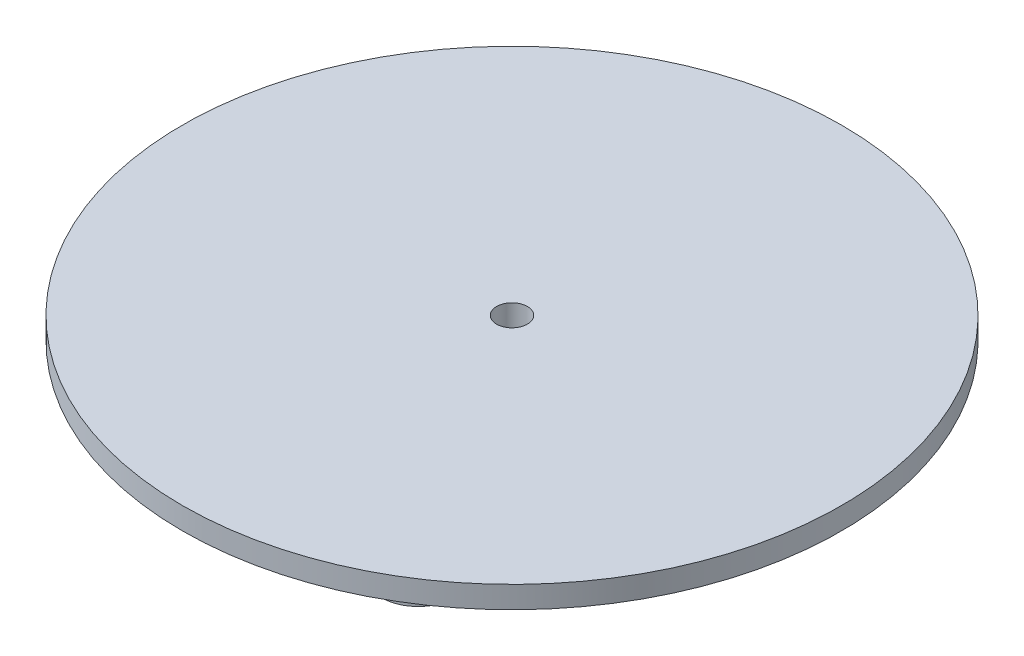
ISO-10303-21;
HEADER;
FILE_DESCRIPTION(('STEP AP214'),'2;1');
FILE_NAME('part.step','',(''),(''),'','','');
FILE_SCHEMA(('AUTOMOTIVE_DESIGN { 1 0 10303 214 1 1 1 1 }'));
ENDSEC;
DATA;
#1=APPLICATION_CONTEXT('core data for automotive mechanical design processes');
#2=APPLICATION_PROTOCOL_DEFINITION('international standard','automotive_design',2000,#1);
#3=PRODUCT_CONTEXT('',#1,'mechanical');
#4=PRODUCT('Part','Part','',(#3));
#5=PRODUCT_RELATED_PRODUCT_CATEGORY('part','',(#4));
#6=PRODUCT_DEFINITION_FORMATION('','',#4);
#7=PRODUCT_DEFINITION_CONTEXT('part definition',#1,'design');
#8=PRODUCT_DEFINITION('design','',#6,#7);
#9=PRODUCT_DEFINITION_SHAPE('','',#8);
#10=(LENGTH_UNIT() NAMED_UNIT(*) SI_UNIT(.MILLI.,.METRE.));
#11=(NAMED_UNIT(*) PLANE_ANGLE_UNIT() SI_UNIT($,.RADIAN.));
#12=(NAMED_UNIT(*) SI_UNIT($,.STERADIAN.) SOLID_ANGLE_UNIT());
#13=UNCERTAINTY_MEASURE_WITH_UNIT(LENGTH_MEASURE(1.E-05),#10,'distance_accuracy_value','');
#14=(GEOMETRIC_REPRESENTATION_CONTEXT(3) GLOBAL_UNCERTAINTY_ASSIGNED_CONTEXT((#13)) GLOBAL_UNIT_ASSIGNED_CONTEXT((#10,
#11,#12)) REPRESENTATION_CONTEXT('',''));
#15=CARTESIAN_POINT('',(0.,0.,0.));
#16=DIRECTION('',(0.,0.,1.));
#17=DIRECTION('',(1.,0.,0.));
#18=AXIS2_PLACEMENT_3D('',#15,#16,#17);
#19=CARTESIAN_POINT('',(0.,-3.,0.));
#20=DIRECTION('',(0.,1.,0.));
#21=DIRECTION('',(0.,0.,1.));
#22=AXIS2_PLACEMENT_3D('',#19,#20,#21);
#23=PLANE('',#22);
#24=CARTESIAN_POINT('',(17.5000000000001,-3.,30.3108891324553));
#25=DIRECTION('',(0.,1.,0.));
#26=DIRECTION('',(0.,0.,1.));
#27=AXIS2_PLACEMENT_3D('',#24,#25,#26);
#28=CIRCLE('',#27,5.);
#29=CARTESIAN_POINT('',(17.5000000000001,-3.,35.3108891324553));
#30=VERTEX_POINT('',#29);
#31=EDGE_CURVE('E37',#30,#30,#28,.F.);
#32=ORIENTED_EDGE('',*,*,#31,.F.);
#33=EDGE_LOOP('',(#32));
#34=FACE_BOUND('',#33,.T.);
#35=CARTESIAN_POINT('',(0.,-3.,0.));
#36=DIRECTION('',(0.,1.,0.));
#37=DIRECTION('',(0.,0.,1.));
#38=AXIS2_PLACEMENT_3D('',#35,#36,#37);
#39=CIRCLE('',#38,6.75);
#40=CARTESIAN_POINT('',(0.,-3.,6.75));
#41=VERTEX_POINT('',#40);
#42=EDGE_CURVE('E46',#41,#41,#39,.F.);
#43=ORIENTED_EDGE('',*,*,#42,.F.);
#44=EDGE_LOOP('',(#43));
#45=FACE_BOUND('',#44,.T.);
#46=CARTESIAN_POINT('',(0.,-3.,0.));
#47=DIRECTION('',(0.,1.,0.));
#48=DIRECTION('',(0.,0.,1.));
#49=AXIS2_PLACEMENT_3D('',#46,#47,#48);
#50=CIRCLE('',#49,45.);
#51=CARTESIAN_POINT('',(0.,-3.,45.));
#52=VERTEX_POINT('',#51);
#53=EDGE_CURVE('E49',#52,#52,#50,.T.);
#54=ORIENTED_EDGE('',*,*,#53,.F.);
#55=EDGE_LOOP('',(#54));
#56=FACE_BOUND('',#55,.T.);
#57=CARTESIAN_POINT('',(-35.,-3.,0.));
#58=DIRECTION('',(0.,1.,0.));
#59=DIRECTION('',(0.,0.,1.));
#60=AXIS2_PLACEMENT_3D('',#57,#58,#59);
#61=CIRCLE('',#60,5.);
#62=CARTESIAN_POINT('',(-35.,-3.,5.));
#63=VERTEX_POINT('',#62);
#64=EDGE_CURVE('E41',#63,#63,#61,.F.);
#65=ORIENTED_EDGE('',*,*,#64,.F.);
#66=EDGE_LOOP('',(#65));
#67=FACE_BOUND('',#66,.T.);
#68=CARTESIAN_POINT('',(17.4999999999997,-3.,-30.3108891324555));
#69=DIRECTION('',(0.,1.,0.));
#70=DIRECTION('',(0.,0.,1.));
#71=AXIS2_PLACEMENT_3D('',#68,#69,#70);
#72=CIRCLE('',#71,5.);
#73=CARTESIAN_POINT('',(17.4999999999997,-3.,-25.3108891324555));
#74=VERTEX_POINT('',#73);
#75=EDGE_CURVE('E10',#74,#74,#72,.F.);
#76=ORIENTED_EDGE('',*,*,#75,.F.);
#77=EDGE_LOOP('',(#76));
#78=FACE_BOUND('',#77,.T.);
#79=ADVANCED_FACE('F29',(#34,#45,#56,#67,#78),#23,.F.);
#80=CARTESIAN_POINT('',(0.,-3.,0.));
#81=DIRECTION('',(0.,1.,0.));
#82=DIRECTION('',(0.,0.,1.));
#83=AXIS2_PLACEMENT_3D('',#80,#81,#82);
#84=CYLINDRICAL_SURFACE('',#83,45.);
#85=ORIENTED_EDGE('',*,*,#53,.T.);
#86=EDGE_LOOP('',(#85));
#87=FACE_BOUND('',#86,.T.);
#88=CARTESIAN_POINT('',(0.,0.,0.));
#89=DIRECTION('',(0.,1.,0.));
#90=DIRECTION('',(0.,0.,1.));
#91=AXIS2_PLACEMENT_3D('',#88,#89,#90);
#92=CIRCLE('',#91,45.);
#93=CARTESIAN_POINT('',(0.,0.,45.));
#94=VERTEX_POINT('',#93);
#95=EDGE_CURVE('E50',#94,#94,#92,.T.);
#96=ORIENTED_EDGE('',*,*,#95,.F.);
#97=EDGE_LOOP('',(#96));
#98=FACE_BOUND('',#97,.T.);
#99=ADVANCED_FACE('F31',(#87,#98),#84,.T.);
#100=CARTESIAN_POINT('',(0.,0.,0.));
#101=DIRECTION('',(0.,1.,0.));
#102=DIRECTION('',(0.,0.,1.));
#103=AXIS2_PLACEMENT_3D('',#100,#101,#102);
#104=PLANE('',#103);
#105=CARTESIAN_POINT('',(0.,0.,0.));
#106=DIRECTION('',(0.,1.,0.));
#107=DIRECTION('',(0.,0.,1.));
#108=AXIS2_PLACEMENT_3D('',#105,#106,#107);
#109=CIRCLE('',#108,2.1);
#110=CARTESIAN_POINT('',(0.,0.,2.1));
#111=VERTEX_POINT('',#110);
#112=EDGE_CURVE('E73',#111,#111,#109,.T.);
#113=ORIENTED_EDGE('',*,*,#112,.F.);
#114=EDGE_LOOP('',(#113));
#115=FACE_BOUND('',#114,.T.);
#116=ORIENTED_EDGE('',*,*,#95,.T.);
#117=EDGE_LOOP('',(#116));
#118=FACE_BOUND('',#117,.T.);
#119=ADVANCED_FACE('F99',(#115,#118),#104,.T.);
#120=CARTESIAN_POINT('',(0.,-7.,0.));
#121=DIRECTION('',(0.,-1.,0.));
#122=DIRECTION('',(0.,0.,-1.));
#123=AXIS2_PLACEMENT_3D('',#120,#121,#122);
#124=PLANE('',#123);
#125=CARTESIAN_POINT('',(0.,-7.,0.));
#126=DIRECTION('',(0.,-1.,0.));
#127=DIRECTION('',(0.,0.,-1.));
#128=AXIS2_PLACEMENT_3D('',#125,#126,#127);
#129=CIRCLE('',#128,6.75);
#130=CARTESIAN_POINT('',(0.,-7.,-6.75));
#131=VERTEX_POINT('',#130);
#132=EDGE_CURVE('E53',#131,#131,#129,.T.);
#133=ORIENTED_EDGE('',*,*,#132,.T.);
#134=EDGE_LOOP('',(#133));
#135=FACE_BOUND('',#134,.T.);
#136=CARTESIAN_POINT('',(0.,-7.,0.));
#137=DIRECTION('',(0.,-1.,0.));
#138=DIRECTION('',(0.,0.,-1.));
#139=AXIS2_PLACEMENT_3D('',#136,#137,#138);
#140=CIRCLE('',#139,3.75);
#141=CARTESIAN_POINT('',(0.,-7.,-3.75));
#142=VERTEX_POINT('',#141);
#143=EDGE_CURVE('E58',#142,#142,#140,.T.);
#144=ORIENTED_EDGE('',*,*,#143,.F.);
#145=EDGE_LOOP('',(#144));
#146=FACE_BOUND('',#145,.T.);
#147=ADVANCED_FACE('F120',(#135,#146),#124,.T.);
#148=CARTESIAN_POINT('',(0.,-7.,0.));
#149=DIRECTION('',(0.,1.,0.));
#150=DIRECTION('',(0.,0.,1.));
#151=AXIS2_PLACEMENT_3D('',#148,#149,#150);
#152=CYLINDRICAL_SURFACE('',#151,6.75);
#153=ORIENTED_EDGE('',*,*,#132,.F.);
#154=EDGE_LOOP('',(#153));
#155=FACE_BOUND('',#154,.T.);
#156=ORIENTED_EDGE('',*,*,#42,.T.);
#157=EDGE_LOOP('',(#156));
#158=FACE_BOUND('',#157,.T.);
#159=ADVANCED_FACE('F114',(#155,#158),#152,.T.);
#160=CARTESIAN_POINT('',(0.,-7.,0.));
#161=DIRECTION('',(0.,1.,0.));
#162=DIRECTION('',(0.,0.,1.));
#163=AXIS2_PLACEMENT_3D('',#160,#161,#162);
#164=CYLINDRICAL_SURFACE('',#163,3.75);
#165=ORIENTED_EDGE('',*,*,#143,.T.);
#166=EDGE_LOOP('',(#165));
#167=FACE_BOUND('',#166,.T.);
#168=CARTESIAN_POINT('',(0.,-3.,0.));
#169=DIRECTION('',(0.,-1.,0.));
#170=DIRECTION('',(0.,0.,-1.));
#171=AXIS2_PLACEMENT_3D('',#168,#169,#170);
#172=CIRCLE('',#171,3.75);
#173=CARTESIAN_POINT('',(0.,-3.,-3.75));
#174=VERTEX_POINT('',#173);
#175=EDGE_CURVE('E59',#174,#174,#172,.T.);
#176=ORIENTED_EDGE('',*,*,#175,.F.);
#177=EDGE_LOOP('',(#176));
#178=FACE_BOUND('',#177,.T.);
#179=ADVANCED_FACE('F106',(#167,#178),#164,.F.);
#180=CARTESIAN_POINT('',(0.,-3.,0.));
#181=DIRECTION('',(0.,1.,0.));
#182=DIRECTION('',(0.,0.,1.));
#183=AXIS2_PLACEMENT_3D('',#180,#181,#182);
#184=CIRCLE('',#183,2.1);
#185=CARTESIAN_POINT('',(0.,-3.,2.1));
#186=VERTEX_POINT('',#185);
#187=EDGE_CURVE('E33',#186,#186,#184,.T.);
#188=ORIENTED_EDGE('',*,*,#187,.T.);
#189=EDGE_LOOP('',(#188));
#190=FACE_BOUND('',#189,.T.);
#191=ORIENTED_EDGE('',*,*,#175,.T.);
#192=EDGE_LOOP('',(#191));
#193=FACE_BOUND('',#192,.T.);
#194=ADVANCED_FACE('F80',(#190,#193),#23,.F.);
#195=CARTESIAN_POINT('',(-35.,-7.,0.));
#196=DIRECTION('',(0.,1.,0.));
#197=DIRECTION('',(0.,0.,1.));
#198=AXIS2_PLACEMENT_3D('',#195,#196,#197);
#199=CYLINDRICAL_SURFACE('',#198,5.);
#200=CARTESIAN_POINT('',(-35.,-7.,0.));
#201=DIRECTION('',(0.,-1.,0.));
#202=DIRECTION('',(0.,0.,-1.));
#203=AXIS2_PLACEMENT_3D('',#200,#201,#202);
#204=CIRCLE('',#203,5.);
#205=CARTESIAN_POINT('',(-35.,-7.,-5.));
#206=VERTEX_POINT('',#205);
#207=EDGE_CURVE('E62',#206,#206,#204,.T.);
#208=ORIENTED_EDGE('',*,*,#207,.F.);
#209=EDGE_LOOP('',(#208));
#210=FACE_BOUND('',#209,.T.);
#211=ORIENTED_EDGE('',*,*,#64,.T.);
#212=EDGE_LOOP('',(#211));
#213=FACE_BOUND('',#212,.T.);
#214=ADVANCED_FACE('F105',(#210,#213),#199,.T.);
#215=CARTESIAN_POINT('',(-35.,-7.,0.));
#216=DIRECTION('',(0.,-1.,0.));
#217=DIRECTION('',(0.,0.,-1.));
#218=AXIS2_PLACEMENT_3D('',#215,#216,#217);
#219=PLANE('',#218);
#220=ORIENTED_EDGE('',*,*,#207,.T.);
#221=EDGE_LOOP('',(#220));
#222=FACE_BOUND('',#221,.T.);
#223=ADVANCED_FACE('F111',(#222),#219,.T.);
#224=CARTESIAN_POINT('',(17.5000000000001,-7.,30.3108891324553));
#225=DIRECTION('',(0.,1.,0.));
#226=DIRECTION('',(0.,0.,1.));
#227=AXIS2_PLACEMENT_3D('',#224,#225,#226);
#228=CYLINDRICAL_SURFACE('',#227,5.);
#229=CARTESIAN_POINT('',(17.5000000000001,-7.,30.3108891324553));
#230=DIRECTION('',(0.,-1.,0.));
#231=DIRECTION('',(0.,0.,-1.));
#232=AXIS2_PLACEMENT_3D('',#229,#230,#231);
#233=CIRCLE('',#232,5.);
#234=CARTESIAN_POINT('',(17.5000000000001,-7.,25.3108891324553));
#235=VERTEX_POINT('',#234);
#236=EDGE_CURVE('E67',#235,#235,#233,.T.);
#237=ORIENTED_EDGE('',*,*,#236,.F.);
#238=EDGE_LOOP('',(#237));
#239=FACE_BOUND('',#238,.T.);
#240=ORIENTED_EDGE('',*,*,#31,.T.);
#241=EDGE_LOOP('',(#240));
#242=FACE_BOUND('',#241,.T.);
#243=ADVANCED_FACE('F186',(#239,#242),#228,.T.);
#244=CARTESIAN_POINT('',(17.5000000000001,-7.,30.3108891324553));
#245=DIRECTION('',(0.,-1.,0.));
#246=DIRECTION('',(0.,0.,-1.));
#247=AXIS2_PLACEMENT_3D('',#244,#245,#246);
#248=PLANE('',#247);
#249=ORIENTED_EDGE('',*,*,#236,.T.);
#250=EDGE_LOOP('',(#249));
#251=FACE_BOUND('',#250,.T.);
#252=ADVANCED_FACE('F195',(#251),#248,.T.);
#253=CARTESIAN_POINT('',(17.4999999999997,-7.,-30.3108891324555));
#254=DIRECTION('',(0.,1.,0.));
#255=DIRECTION('',(0.,0.,1.));
#256=AXIS2_PLACEMENT_3D('',#253,#254,#255);
#257=CYLINDRICAL_SURFACE('',#256,5.);
#258=CARTESIAN_POINT('',(17.4999999999997,-7.,-30.3108891324555));
#259=DIRECTION('',(0.,-1.,0.));
#260=DIRECTION('',(0.,0.,-1.));
#261=AXIS2_PLACEMENT_3D('',#258,#259,#260);
#262=CIRCLE('',#261,5.);
#263=CARTESIAN_POINT('',(17.4999999999997,-7.,-35.3108891324555));
#264=VERTEX_POINT('',#263);
#265=EDGE_CURVE('E70',#264,#264,#262,.T.);
#266=ORIENTED_EDGE('',*,*,#265,.F.);
#267=EDGE_LOOP('',(#266));
#268=FACE_BOUND('',#267,.T.);
#269=ORIENTED_EDGE('',*,*,#75,.T.);
#270=EDGE_LOOP('',(#269));
#271=FACE_BOUND('',#270,.T.);
#272=ADVANCED_FACE('F90',(#268,#271),#257,.T.);
#273=CARTESIAN_POINT('',(17.4999999999997,-7.,-30.3108891324555));
#274=DIRECTION('',(0.,-1.,0.));
#275=DIRECTION('',(0.,0.,-1.));
#276=AXIS2_PLACEMENT_3D('',#273,#274,#275);
#277=PLANE('',#276);
#278=ORIENTED_EDGE('',*,*,#265,.T.);
#279=EDGE_LOOP('',(#278));
#280=FACE_BOUND('',#279,.T.);
#281=ADVANCED_FACE('F85',(#280),#277,.T.);
#282=CARTESIAN_POINT('',(0.,-7.,0.));
#283=DIRECTION('',(0.,1.,0.));
#284=DIRECTION('',(0.,0.,1.));
#285=AXIS2_PLACEMENT_3D('',#282,#283,#284);
#286=CYLINDRICAL_SURFACE('',#285,2.1);
#287=ORIENTED_EDGE('',*,*,#112,.T.);
#288=EDGE_LOOP('',(#287));
#289=FACE_BOUND('',#288,.T.);
#290=ORIENTED_EDGE('',*,*,#187,.F.);
#291=EDGE_LOOP('',(#290));
#292=FACE_BOUND('',#291,.T.);
#293=ADVANCED_FACE('F83',(#289,#292),#286,.F.);
#294=CLOSED_SHELL('',(#79,#99,#119,#147,#159,#179,#194,#214,#223,#243,#252,#272,#281,#293));
#295=MANIFOLD_SOLID_BREP('B2',#294);
#296=ADVANCED_BREP_SHAPE_REPRESENTATION('',(#18,#295),#14);
#297=SHAPE_DEFINITION_REPRESENTATION(#9,#296);
ENDSEC;
END-ISO-10303-21;
